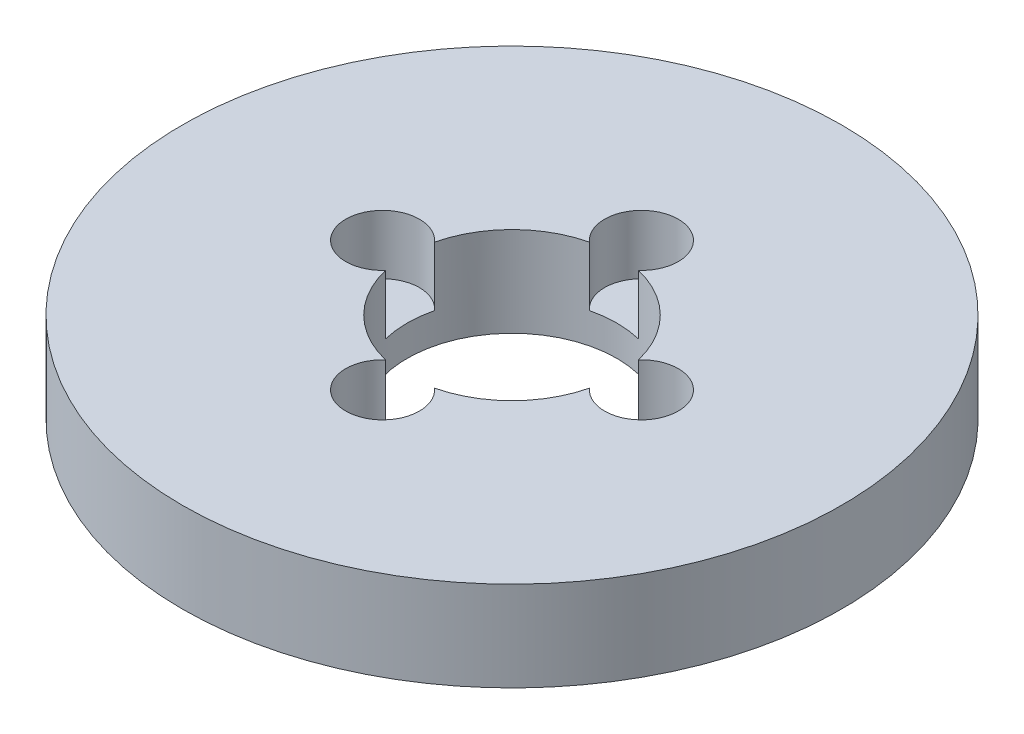
ISO-10303-21;
HEADER;
FILE_DESCRIPTION(('STEP AP214'),'2;1');
FILE_NAME('part.step','',(''),(''),'','','');
FILE_SCHEMA(('AUTOMOTIVE_DESIGN { 1 0 10303 214 1 1 1 1 }'));
ENDSEC;
DATA;
#1=APPLICATION_CONTEXT('core data for automotive mechanical design processes');
#2=APPLICATION_PROTOCOL_DEFINITION('international standard','automotive_design',2000,#1);
#3=PRODUCT_CONTEXT('',#1,'mechanical');
#4=PRODUCT('Part','Part','',(#3));
#5=PRODUCT_RELATED_PRODUCT_CATEGORY('part','',(#4));
#6=PRODUCT_DEFINITION_FORMATION('','',#4);
#7=PRODUCT_DEFINITION_CONTEXT('part definition',#1,'design');
#8=PRODUCT_DEFINITION('design','',#6,#7);
#9=PRODUCT_DEFINITION_SHAPE('','',#8);
#10=(LENGTH_UNIT() NAMED_UNIT(*) SI_UNIT(.MILLI.,.METRE.));
#11=(NAMED_UNIT(*) PLANE_ANGLE_UNIT() SI_UNIT($,.RADIAN.));
#12=(NAMED_UNIT(*) SI_UNIT($,.STERADIAN.) SOLID_ANGLE_UNIT());
#13=UNCERTAINTY_MEASURE_WITH_UNIT(LENGTH_MEASURE(1.E-05),#10,'distance_accuracy_value','');
#14=(GEOMETRIC_REPRESENTATION_CONTEXT(3) GLOBAL_UNCERTAINTY_ASSIGNED_CONTEXT((#13)) GLOBAL_UNIT_ASSIGNED_CONTEXT((#10,
#11,#12)) REPRESENTATION_CONTEXT('',''));
#15=CARTESIAN_POINT('',(0.,0.,0.));
#16=DIRECTION('',(0.,0.,1.));
#17=DIRECTION('',(1.,0.,0.));
#18=AXIS2_PLACEMENT_3D('',#15,#16,#17);
#19=CARTESIAN_POINT('',(0.,15.,0.));
#20=DIRECTION('',(0.,-1.,0.));
#21=DIRECTION('',(0.,0.,-1.));
#22=AXIS2_PLACEMENT_3D('',#19,#20,#21);
#23=CYLINDRICAL_SURFACE('',#22,55.);
#24=CARTESIAN_POINT('',(0.,15.,0.));
#25=DIRECTION('',(0.,1.,0.));
#26=DIRECTION('',(0.,0.,1.));
#27=AXIS2_PLACEMENT_3D('',#24,#25,#26);
#28=CIRCLE('',#27,55.);
#29=CARTESIAN_POINT('',(0.,15.,55.));
#30=VERTEX_POINT('',#29);
#31=EDGE_CURVE('E145',#30,#30,#28,.T.);
#32=ORIENTED_EDGE('',*,*,#31,.F.);
#33=EDGE_LOOP('',(#32));
#34=FACE_BOUND('',#33,.T.);
#35=CARTESIAN_POINT('',(0.,0.,0.));
#36=DIRECTION('',(0.,1.,0.));
#37=DIRECTION('',(0.,0.,1.));
#38=AXIS2_PLACEMENT_3D('',#35,#36,#37);
#39=CIRCLE('',#38,55.);
#40=CARTESIAN_POINT('',(0.,0.,55.));
#41=VERTEX_POINT('',#40);
#42=EDGE_CURVE('E143',#41,#41,#39,.T.);
#43=ORIENTED_EDGE('',*,*,#42,.T.);
#44=EDGE_LOOP('',(#43));
#45=FACE_BOUND('',#44,.T.);
#46=ADVANCED_FACE('F39',(#34,#45),#23,.T.);
#47=CARTESIAN_POINT('',(0.,15.,0.));
#48=DIRECTION('',(0.,1.,0.));
#49=DIRECTION('',(0.,0.,1.));
#50=AXIS2_PLACEMENT_3D('',#47,#48,#49);
#51=PLANE('',#50);
#52=CARTESIAN_POINT('',(0.,15.,21.6005793733192));
#53=DIRECTION('',(0.,1.,0.));
#54=DIRECTION('',(1.,0.,0.));
#55=AXIS2_PLACEMENT_3D('',#52,#53,#54);
#56=CIRCLE('',#55,6.1458261901049);
#57=CARTESIAN_POINT('',(-4.09179918515586,15.,17.0149105030957));
#58=VERTEX_POINT('',#57);
#59=CARTESIAN_POINT('',(4.09179918515597,15.,17.0149105030957));
#60=VERTEX_POINT('',#59);
#61=EDGE_CURVE('E152',#58,#60,#56,.T.);
#62=ORIENTED_EDGE('',*,*,#61,.F.);
#63=CARTESIAN_POINT('',(0.,15.,0.));
#64=DIRECTION('',(0.,1.,0.));
#65=DIRECTION('',(0.,0.,1.));
#66=AXIS2_PLACEMENT_3D('',#63,#64,#65);
#67=CIRCLE('',#66,17.5);
#68=CARTESIAN_POINT('',(-17.0149105030957,15.,4.09179918515592));
#69=VERTEX_POINT('',#68);
#70=EDGE_CURVE('E133',#69,#58,#67,.T.);
#71=ORIENTED_EDGE('',*,*,#70,.F.);
#72=CARTESIAN_POINT('',(-21.6005793733192,15.,0.));
#73=DIRECTION('',(0.,1.,0.));
#74=DIRECTION('',(0.,0.,1.));
#75=AXIS2_PLACEMENT_3D('',#72,#73,#74);
#76=CIRCLE('',#75,6.1458261901049);
#77=CARTESIAN_POINT('',(-17.0149105030957,15.,-4.09179918515592));
#78=VERTEX_POINT('',#77);
#79=EDGE_CURVE('E128',#78,#69,#76,.T.);
#80=ORIENTED_EDGE('',*,*,#79,.F.);
#81=CARTESIAN_POINT('',(-4.09179918515609,15.,-17.0149105030957));
#82=VERTEX_POINT('',#81);
#83=EDGE_CURVE('E121',#82,#78,#67,.T.);
#84=ORIENTED_EDGE('',*,*,#83,.F.);
#85=CARTESIAN_POINT('',(-2.26254059370432E-13,15.,-21.6005793733192));
#86=DIRECTION('',(0.,1.,0.));
#87=DIRECTION('',(-1.,0.,0.));
#88=AXIS2_PLACEMENT_3D('',#85,#86,#87);
#89=CIRCLE('',#88,6.1458261901049);
#90=CARTESIAN_POINT('',(4.09179918515574,15.,-17.0149105030958));
#91=VERTEX_POINT('',#90);
#92=EDGE_CURVE('E105',#91,#82,#89,.T.);
#93=ORIENTED_EDGE('',*,*,#92,.F.);
#94=CARTESIAN_POINT('',(17.0149105030957,15.,-4.09179918515592));
#95=VERTEX_POINT('',#94);
#96=EDGE_CURVE('E131',#95,#91,#67,.T.);
#97=ORIENTED_EDGE('',*,*,#96,.F.);
#98=CARTESIAN_POINT('',(21.6005793733192,15.,0.));
#99=DIRECTION('',(0.,1.,0.));
#100=DIRECTION('',(0.,0.,-1.));
#101=AXIS2_PLACEMENT_3D('',#98,#99,#100);
#102=CIRCLE('',#101,6.1458261901049);
#103=CARTESIAN_POINT('',(17.0149105030957,15.,4.09179918515592));
#104=VERTEX_POINT('',#103);
#105=EDGE_CURVE('E154',#104,#95,#102,.T.);
#106=ORIENTED_EDGE('',*,*,#105,.F.);
#107=EDGE_CURVE('E134',#60,#104,#67,.T.);
#108=ORIENTED_EDGE('',*,*,#107,.F.);
#109=EDGE_LOOP('',(#62,#71,#80,#84,#93,#97,#106,#108));
#110=FACE_BOUND('',#109,.T.);
#111=ORIENTED_EDGE('',*,*,#31,.T.);
#112=EDGE_LOOP('',(#111));
#113=FACE_BOUND('',#112,.T.);
#114=ADVANCED_FACE('F130',(#110,#113),#51,.T.);
#115=CARTESIAN_POINT('',(0.,0.,0.));
#116=DIRECTION('',(0.,1.,0.));
#117=DIRECTION('',(0.,0.,1.));
#118=AXIS2_PLACEMENT_3D('',#115,#116,#117);
#119=PLANE('',#118);
#120=CARTESIAN_POINT('',(0.,0.,0.));
#121=DIRECTION('',(0.,1.,0.));
#122=DIRECTION('',(0.,0.,1.));
#123=AXIS2_PLACEMENT_3D('',#120,#121,#122);
#124=CIRCLE('',#123,17.5);
#125=CARTESIAN_POINT('',(0.,0.,17.5));
#126=VERTEX_POINT('',#125);
#127=EDGE_CURVE('E135',#126,#126,#124,.T.);
#128=ORIENTED_EDGE('',*,*,#127,.T.);
#129=EDGE_LOOP('',(#128));
#130=FACE_BOUND('',#129,.T.);
#131=ORIENTED_EDGE('',*,*,#42,.F.);
#132=EDGE_LOOP('',(#131));
#133=FACE_BOUND('',#132,.T.);
#134=ADVANCED_FACE('F195',(#130,#133),#119,.F.);
#135=CARTESIAN_POINT('',(0.,15.,0.));
#136=DIRECTION('',(0.,-1.,0.));
#137=DIRECTION('',(0.,0.,-1.));
#138=AXIS2_PLACEMENT_3D('',#135,#136,#137);
#139=CYLINDRICAL_SURFACE('',#138,17.5);
#140=DIRECTION('',(0.,1.,0.));
#141=VECTOR('',#140,1.);
#142=CARTESIAN_POINT('',(-4.09179918515586,10.0530385996842,17.0149105030958));
#143=LINE('',#142,#141);
#144=CARTESIAN_POINT('',(-4.09179918515586,5.10607719936845,17.0149105030957));
#145=VERTEX_POINT('',#144);
#146=EDGE_CURVE('E11',#145,#58,#143,.T.);
#147=ORIENTED_EDGE('',*,*,#146,.F.);
#148=CARTESIAN_POINT('',(0.,5.10607719936845,0.));
#149=DIRECTION('',(0.,1.,0.));
#150=DIRECTION('',(0.,0.,1.));
#151=AXIS2_PLACEMENT_3D('',#148,#149,#150);
#152=CIRCLE('',#151,17.5);
#153=CARTESIAN_POINT('',(4.09179918515597,5.10607719936845,17.0149105030957));
#154=VERTEX_POINT('',#153);
#155=EDGE_CURVE('E169',#145,#154,#152,.T.);
#156=ORIENTED_EDGE('',*,*,#155,.T.);
#157=DIRECTION('',(0.,1.,0.));
#158=VECTOR('',#157,1.);
#159=CARTESIAN_POINT('',(4.09179918515598,10.0530385996842,17.0149105030957));
#160=LINE('',#159,#158);
#161=EDGE_CURVE('E46',#60,#154,#160,.F.);
#162=ORIENTED_EDGE('',*,*,#161,.F.);
#163=ORIENTED_EDGE('',*,*,#107,.T.);
#164=DIRECTION('',(0.,1.,0.));
#165=VECTOR('',#164,1.);
#166=CARTESIAN_POINT('',(17.0149105030957,10.0530385996842,4.09179918515592));
#167=LINE('',#166,#165);
#168=CARTESIAN_POINT('',(17.0149105030957,5.10607719936845,4.09179918515592));
#169=VERTEX_POINT('',#168);
#170=EDGE_CURVE('E151',#169,#104,#167,.T.);
#171=ORIENTED_EDGE('',*,*,#170,.F.);
#172=CARTESIAN_POINT('',(0.,5.10607719936845,0.));
#173=DIRECTION('',(0.,1.,0.));
#174=DIRECTION('',(0.,0.,1.));
#175=AXIS2_PLACEMENT_3D('',#172,#173,#174);
#176=CIRCLE('',#175,17.5);
#177=CARTESIAN_POINT('',(17.0149105030957,5.10607719936845,-4.09179918515592));
#178=VERTEX_POINT('',#177);
#179=EDGE_CURVE('E173',#169,#178,#176,.T.);
#180=ORIENTED_EDGE('',*,*,#179,.T.);
#181=DIRECTION('',(0.,1.,0.));
#182=VECTOR('',#181,1.);
#183=CARTESIAN_POINT('',(17.0149105030957,10.0530385996842,-4.09179918515592));
#184=LINE('',#183,#182);
#185=EDGE_CURVE('E168',#95,#178,#184,.F.);
#186=ORIENTED_EDGE('',*,*,#185,.F.);
#187=ORIENTED_EDGE('',*,*,#96,.T.);
#188=DIRECTION('',(0.,1.,0.));
#189=VECTOR('',#188,1.);
#190=CARTESIAN_POINT('',(4.09179918515574,10.0530385996842,-17.0149105030958));
#191=LINE('',#190,#189);
#192=CARTESIAN_POINT('',(4.09179918515574,5.10607719936845,-17.0149105030958));
#193=VERTEX_POINT('',#192);
#194=EDGE_CURVE('E108',#193,#91,#191,.T.);
#195=ORIENTED_EDGE('',*,*,#194,.F.);
#196=CARTESIAN_POINT('',(0.,5.10607719936845,0.));
#197=DIRECTION('',(0.,1.,0.));
#198=DIRECTION('',(0.,0.,1.));
#199=AXIS2_PLACEMENT_3D('',#196,#197,#198);
#200=CIRCLE('',#199,17.5);
#201=CARTESIAN_POINT('',(-4.09179918515609,5.10607719936845,-17.0149105030957));
#202=VERTEX_POINT('',#201);
#203=EDGE_CURVE('E122',#193,#202,#200,.T.);
#204=ORIENTED_EDGE('',*,*,#203,.T.);
#205=DIRECTION('',(0.,1.,0.));
#206=VECTOR('',#205,1.);
#207=CARTESIAN_POINT('',(-4.0917991851561,10.0530385996842,-17.0149105030957));
#208=LINE('',#207,#206);
#209=EDGE_CURVE('E106',#82,#202,#208,.F.);
#210=ORIENTED_EDGE('',*,*,#209,.F.);
#211=ORIENTED_EDGE('',*,*,#83,.T.);
#212=DIRECTION('',(0.,1.,0.));
#213=VECTOR('',#212,1.);
#214=CARTESIAN_POINT('',(-17.0149105030957,10.0530385996842,-4.09179918515592));
#215=LINE('',#214,#213);
#216=CARTESIAN_POINT('',(-17.0149105030957,5.10607719936845,-4.09179918515592));
#217=VERTEX_POINT('',#216);
#218=EDGE_CURVE('E177',#217,#78,#215,.T.);
#219=ORIENTED_EDGE('',*,*,#218,.F.);
#220=CARTESIAN_POINT('',(0.,5.10607719936845,0.));
#221=DIRECTION('',(0.,1.,0.));
#222=DIRECTION('',(0.,0.,1.));
#223=AXIS2_PLACEMENT_3D('',#220,#221,#222);
#224=CIRCLE('',#223,17.5);
#225=CARTESIAN_POINT('',(-17.0149105030957,5.10607719936845,4.09179918515592));
#226=VERTEX_POINT('',#225);
#227=EDGE_CURVE('E185',#217,#226,#224,.T.);
#228=ORIENTED_EDGE('',*,*,#227,.T.);
#229=DIRECTION('',(0.,1.,0.));
#230=VECTOR('',#229,1.);
#231=CARTESIAN_POINT('',(-17.0149105030957,10.0530385996842,4.09179918515592));
#232=LINE('',#231,#230);
#233=EDGE_CURVE('E179',#69,#226,#232,.F.);
#234=ORIENTED_EDGE('',*,*,#233,.F.);
#235=ORIENTED_EDGE('',*,*,#70,.T.);
#236=EDGE_LOOP('',(#147,#156,#162,#163,#171,#180,#186,#187,#195,#204,#210,#211,#219,#228,#234,#235));
#237=FACE_BOUND('',#236,.T.);
#238=ORIENTED_EDGE('',*,*,#127,.F.);
#239=EDGE_LOOP('',(#238));
#240=FACE_BOUND('',#239,.T.);
#241=ADVANCED_FACE('F117',(#237,#240),#139,.F.);
#242=CARTESIAN_POINT('',(-21.6005793733192,5.10607719936845,0.));
#243=DIRECTION('',(0.,1.,0.));
#244=DIRECTION('',(0.,0.,1.));
#245=AXIS2_PLACEMENT_3D('',#242,#243,#244);
#246=CYLINDRICAL_SURFACE('',#245,6.1458261901049);
#247=ORIENTED_EDGE('',*,*,#218,.T.);
#248=ORIENTED_EDGE('',*,*,#79,.T.);
#249=ORIENTED_EDGE('',*,*,#233,.T.);
#250=CARTESIAN_POINT('',(-21.6005793733192,5.10607719936845,0.));
#251=DIRECTION('',(0.,1.,0.));
#252=DIRECTION('',(0.,0.,1.));
#253=AXIS2_PLACEMENT_3D('',#250,#251,#252);
#254=CIRCLE('',#253,6.1458261901049);
#255=EDGE_CURVE('E140',#217,#226,#254,.T.);
#256=ORIENTED_EDGE('',*,*,#255,.F.);
#257=EDGE_LOOP('',(#247,#248,#249,#256));
#258=FACE_BOUND('',#257,.T.);
#259=ADVANCED_FACE('F200',(#258),#246,.F.);
#260=CARTESIAN_POINT('',(-21.6005793733192,5.10607719936845,0.));
#261=DIRECTION('',(0.,1.,0.));
#262=DIRECTION('',(0.,0.,1.));
#263=AXIS2_PLACEMENT_3D('',#260,#261,#262);
#264=PLANE('',#263);
#265=ORIENTED_EDGE('',*,*,#255,.T.);
#266=ORIENTED_EDGE('',*,*,#227,.F.);
#267=EDGE_LOOP('',(#265,#266));
#268=FACE_BOUND('',#267,.T.);
#269=ADVANCED_FACE('F202',(#268),#264,.T.);
#270=CARTESIAN_POINT('',(-2.26254059370432E-13,5.10607719936845,-21.6005793733192));
#271=DIRECTION('',(0.,1.,0.));
#272=DIRECTION('',(0.,0.,1.));
#273=AXIS2_PLACEMENT_3D('',#270,#271,#272);
#274=CYLINDRICAL_SURFACE('',#273,6.1458261901049);
#275=ORIENTED_EDGE('',*,*,#194,.T.);
#276=ORIENTED_EDGE('',*,*,#92,.T.);
#277=ORIENTED_EDGE('',*,*,#209,.T.);
#278=CARTESIAN_POINT('',(-2.26254059370432E-13,5.10607719936845,-21.6005793733192));
#279=DIRECTION('',(0.,1.,0.));
#280=DIRECTION('',(-1.,0.,0.));
#281=AXIS2_PLACEMENT_3D('',#278,#279,#280);
#282=CIRCLE('',#281,6.1458261901049);
#283=EDGE_CURVE('E111',#193,#202,#282,.T.);
#284=ORIENTED_EDGE('',*,*,#283,.F.);
#285=EDGE_LOOP('',(#275,#276,#277,#284));
#286=FACE_BOUND('',#285,.T.);
#287=ADVANCED_FACE('F102',(#286),#274,.F.);
#288=CARTESIAN_POINT('',(-2.26254059370432E-13,5.10607719936845,-21.6005793733192));
#289=DIRECTION('',(0.,1.,0.));
#290=DIRECTION('',(-1.,0.,0.));
#291=AXIS2_PLACEMENT_3D('',#288,#289,#290);
#292=PLANE('',#291);
#293=ORIENTED_EDGE('',*,*,#283,.T.);
#294=ORIENTED_EDGE('',*,*,#203,.F.);
#295=EDGE_LOOP('',(#293,#294));
#296=FACE_BOUND('',#295,.T.);
#297=ADVANCED_FACE('F211',(#296),#292,.T.);
#298=CARTESIAN_POINT('',(21.6005793733192,5.10607719936845,0.));
#299=DIRECTION('',(0.,1.,0.));
#300=DIRECTION('',(0.,0.,1.));
#301=AXIS2_PLACEMENT_3D('',#298,#299,#300);
#302=CYLINDRICAL_SURFACE('',#301,6.1458261901049);
#303=ORIENTED_EDGE('',*,*,#170,.T.);
#304=ORIENTED_EDGE('',*,*,#105,.T.);
#305=ORIENTED_EDGE('',*,*,#185,.T.);
#306=CARTESIAN_POINT('',(21.6005793733192,5.10607719936845,0.));
#307=DIRECTION('',(0.,1.,0.));
#308=DIRECTION('',(0.,0.,-1.));
#309=AXIS2_PLACEMENT_3D('',#306,#307,#308);
#310=CIRCLE('',#309,6.1458261901049);
#311=EDGE_CURVE('E56',#169,#178,#310,.T.);
#312=ORIENTED_EDGE('',*,*,#311,.F.);
#313=EDGE_LOOP('',(#303,#304,#305,#312));
#314=FACE_BOUND('',#313,.T.);
#315=ADVANCED_FACE('F212',(#314),#302,.F.);
#316=CARTESIAN_POINT('',(21.6005793733192,5.10607719936845,0.));
#317=DIRECTION('',(0.,1.,0.));
#318=DIRECTION('',(0.,0.,-1.));
#319=AXIS2_PLACEMENT_3D('',#316,#317,#318);
#320=PLANE('',#319);
#321=ORIENTED_EDGE('',*,*,#311,.T.);
#322=ORIENTED_EDGE('',*,*,#179,.F.);
#323=EDGE_LOOP('',(#321,#322));
#324=FACE_BOUND('',#323,.T.);
#325=ADVANCED_FACE('F217',(#324),#320,.T.);
#326=CARTESIAN_POINT('',(0.,5.10607719936845,21.6005793733192));
#327=DIRECTION('',(0.,1.,0.));
#328=DIRECTION('',(0.,0.,1.));
#329=AXIS2_PLACEMENT_3D('',#326,#327,#328);
#330=CYLINDRICAL_SURFACE('',#329,6.1458261901049);
#331=ORIENTED_EDGE('',*,*,#146,.T.);
#332=ORIENTED_EDGE('',*,*,#61,.T.);
#333=ORIENTED_EDGE('',*,*,#161,.T.);
#334=CARTESIAN_POINT('',(0.,5.10607719936845,21.6005793733192));
#335=DIRECTION('',(0.,1.,0.));
#336=DIRECTION('',(1.,0.,0.));
#337=AXIS2_PLACEMENT_3D('',#334,#335,#336);
#338=CIRCLE('',#337,6.1458261901049);
#339=EDGE_CURVE('E55',#145,#154,#338,.T.);
#340=ORIENTED_EDGE('',*,*,#339,.F.);
#341=EDGE_LOOP('',(#331,#332,#333,#340));
#342=FACE_BOUND('',#341,.T.);
#343=ADVANCED_FACE('F170',(#342),#330,.F.);
#344=CARTESIAN_POINT('',(0.,5.10607719936845,21.6005793733192));
#345=DIRECTION('',(0.,1.,0.));
#346=DIRECTION('',(1.,0.,0.));
#347=AXIS2_PLACEMENT_3D('',#344,#345,#346);
#348=PLANE('',#347);
#349=ORIENTED_EDGE('',*,*,#339,.T.);
#350=ORIENTED_EDGE('',*,*,#155,.F.);
#351=EDGE_LOOP('',(#349,#350));
#352=FACE_BOUND('',#351,.T.);
#353=ADVANCED_FACE('F224',(#352),#348,.T.);
#354=CLOSED_SHELL('',(#46,#114,#134,#241,#259,#269,#287,#297,#315,#325,#343,#353));
#355=MANIFOLD_SOLID_BREP('B2',#354);
#356=ADVANCED_BREP_SHAPE_REPRESENTATION('',(#18,#355),#14);
#357=SHAPE_DEFINITION_REPRESENTATION(#9,#356);
ENDSEC;
END-ISO-10303-21;
